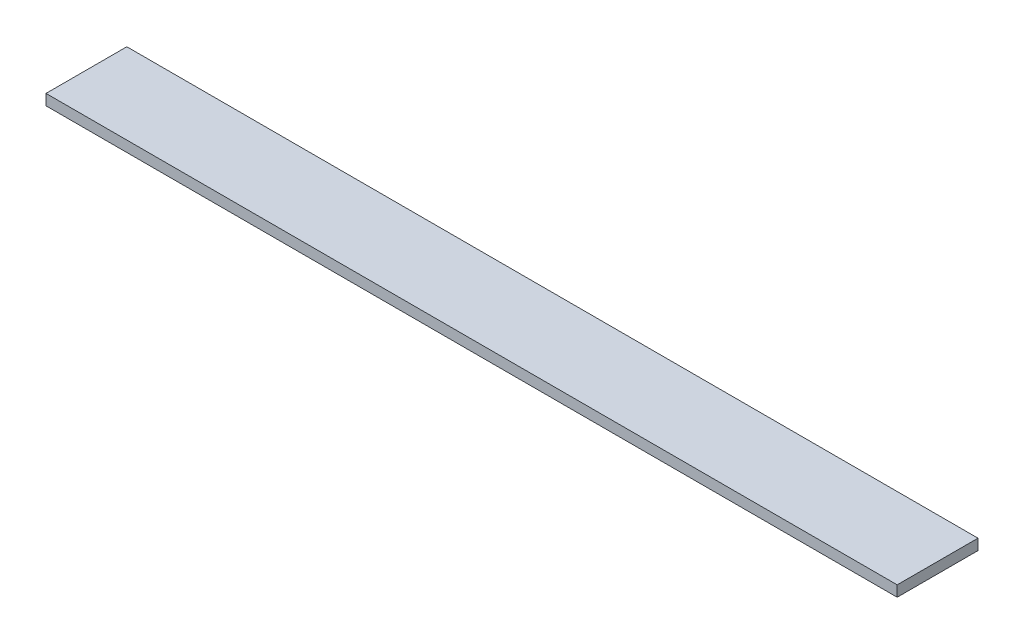
ISO-10303-21;
HEADER;
FILE_DESCRIPTION(('STEP AP214'),'2;1');
FILE_NAME('part.step','',(''),(''),'','','');
FILE_SCHEMA(('AUTOMOTIVE_DESIGN { 1 0 10303 214 1 1 1 1 }'));
ENDSEC;
DATA;
#1=APPLICATION_CONTEXT('core data for automotive mechanical design processes');
#2=APPLICATION_PROTOCOL_DEFINITION('international standard','automotive_design',2000,#1);
#3=PRODUCT_CONTEXT('',#1,'mechanical');
#4=PRODUCT('Part','Part','',(#3));
#5=PRODUCT_RELATED_PRODUCT_CATEGORY('part','',(#4));
#6=PRODUCT_DEFINITION_FORMATION('','',#4);
#7=PRODUCT_DEFINITION_CONTEXT('part definition',#1,'design');
#8=PRODUCT_DEFINITION('design','',#6,#7);
#9=PRODUCT_DEFINITION_SHAPE('','',#8);
#10=(LENGTH_UNIT() NAMED_UNIT(*) SI_UNIT(.MILLI.,.METRE.));
#11=(NAMED_UNIT(*) PLANE_ANGLE_UNIT() SI_UNIT($,.RADIAN.));
#12=(NAMED_UNIT(*) SI_UNIT($,.STERADIAN.) SOLID_ANGLE_UNIT());
#13=UNCERTAINTY_MEASURE_WITH_UNIT(LENGTH_MEASURE(1.E-05),#10,'distance_accuracy_value','');
#14=(GEOMETRIC_REPRESENTATION_CONTEXT(3) GLOBAL_UNCERTAINTY_ASSIGNED_CONTEXT((#13)) GLOBAL_UNIT_ASSIGNED_CONTEXT((#10,
#11,#12)) REPRESENTATION_CONTEXT('',''));
#15=CARTESIAN_POINT('',(0.,0.,0.));
#16=DIRECTION('',(0.,0.,1.));
#17=DIRECTION('',(1.,0.,0.));
#18=AXIS2_PLACEMENT_3D('',#15,#16,#17);
#19=CARTESIAN_POINT('',(316.,-2.,-15.));
#20=DIRECTION('',(0.,0.,1.));
#21=DIRECTION('',(1.,0.,0.));
#22=AXIS2_PLACEMENT_3D('',#19,#20,#21);
#23=PLANE('',#22);
#24=DIRECTION('',(0.,1.,0.));
#25=VECTOR('',#24,1.);
#26=CARTESIAN_POINT('',(0.,-2.,-15.));
#27=LINE('',#26,#25);
#28=CARTESIAN_POINT('',(0.,-2.,-15.));
#29=VERTEX_POINT('',#28);
#30=CARTESIAN_POINT('',(0.,2.,-15.));
#31=VERTEX_POINT('',#30);
#32=EDGE_CURVE('E98',#29,#31,#27,.T.);
#33=ORIENTED_EDGE('',*,*,#32,.T.);
#34=DIRECTION('',(-1.,0.,0.));
#35=VECTOR('',#34,1.);
#36=CARTESIAN_POINT('',(316.,2.,-15.));
#37=LINE('',#36,#35);
#38=CARTESIAN_POINT('',(316.,2.,-15.));
#39=VERTEX_POINT('',#38);
#40=EDGE_CURVE('E11',#39,#31,#37,.T.);
#41=ORIENTED_EDGE('',*,*,#40,.F.);
#42=DIRECTION('',(0.,1.,0.));
#43=VECTOR('',#42,1.);
#44=CARTESIAN_POINT('',(316.,-2.,-15.));
#45=LINE('',#44,#43);
#46=CARTESIAN_POINT('',(316.,-2.,-15.));
#47=VERTEX_POINT('',#46);
#48=EDGE_CURVE('E86',#47,#39,#45,.T.);
#49=ORIENTED_EDGE('',*,*,#48,.F.);
#50=DIRECTION('',(-1.,0.,0.));
#51=VECTOR('',#50,1.);
#52=CARTESIAN_POINT('',(316.,-2.,-15.));
#53=LINE('',#52,#51);
#54=EDGE_CURVE('E94',#47,#29,#53,.T.);
#55=ORIENTED_EDGE('',*,*,#54,.T.);
#56=EDGE_LOOP('',(#33,#41,#49,#55));
#57=FACE_BOUND('',#56,.T.);
#58=ADVANCED_FACE('F35',(#57),#23,.F.);
#59=CARTESIAN_POINT('',(316.,2.,15.));
#60=DIRECTION('',(0.,-1.,0.));
#61=DIRECTION('',(0.,0.,-1.));
#62=AXIS2_PLACEMENT_3D('',#59,#60,#61);
#63=PLANE('',#62);
#64=DIRECTION('',(0.,0.,1.));
#65=VECTOR('',#64,1.);
#66=CARTESIAN_POINT('',(0.,2.,15.));
#67=LINE('',#66,#65);
#68=CARTESIAN_POINT('',(0.,2.,15.));
#69=VERTEX_POINT('',#68);
#70=EDGE_CURVE('E90',#31,#69,#67,.T.);
#71=ORIENTED_EDGE('',*,*,#70,.T.);
#72=DIRECTION('',(-1.,0.,0.));
#73=VECTOR('',#72,1.);
#74=CARTESIAN_POINT('',(316.,2.,15.));
#75=LINE('',#74,#73);
#76=CARTESIAN_POINT('',(316.,2.,15.));
#77=VERTEX_POINT('',#76);
#78=EDGE_CURVE('E43',#77,#69,#75,.T.);
#79=ORIENTED_EDGE('',*,*,#78,.F.);
#80=DIRECTION('',(0.,0.,1.));
#81=VECTOR('',#80,1.);
#82=CARTESIAN_POINT('',(316.,2.,15.));
#83=LINE('',#82,#81);
#84=EDGE_CURVE('E81',#39,#77,#83,.T.);
#85=ORIENTED_EDGE('',*,*,#84,.F.);
#86=ORIENTED_EDGE('',*,*,#40,.T.);
#87=EDGE_LOOP('',(#71,#79,#85,#86));
#88=FACE_BOUND('',#87,.T.);
#89=ADVANCED_FACE('F89',(#88),#63,.F.);
#90=CARTESIAN_POINT('',(316.,-2.,15.));
#91=DIRECTION('',(0.,0.,-1.));
#92=DIRECTION('',(-1.,0.,0.));
#93=AXIS2_PLACEMENT_3D('',#90,#91,#92);
#94=PLANE('',#93);
#95=DIRECTION('',(0.,-1.,0.));
#96=VECTOR('',#95,1.);
#97=CARTESIAN_POINT('',(0.,-2.,15.));
#98=LINE('',#97,#96);
#99=CARTESIAN_POINT('',(0.,-2.,15.));
#100=VERTEX_POINT('',#99);
#101=EDGE_CURVE('E68',#69,#100,#98,.T.);
#102=ORIENTED_EDGE('',*,*,#101,.T.);
#103=DIRECTION('',(-1.,0.,0.));
#104=VECTOR('',#103,1.);
#105=CARTESIAN_POINT('',(316.,-2.,15.));
#106=LINE('',#105,#104);
#107=CARTESIAN_POINT('',(316.,-2.,15.));
#108=VERTEX_POINT('',#107);
#109=EDGE_CURVE('E91',#108,#100,#106,.T.);
#110=ORIENTED_EDGE('',*,*,#109,.F.);
#111=DIRECTION('',(0.,-1.,0.));
#112=VECTOR('',#111,1.);
#113=CARTESIAN_POINT('',(316.,-2.,15.));
#114=LINE('',#113,#112);
#115=EDGE_CURVE('E84',#77,#108,#114,.T.);
#116=ORIENTED_EDGE('',*,*,#115,.F.);
#117=ORIENTED_EDGE('',*,*,#78,.T.);
#118=EDGE_LOOP('',(#102,#110,#116,#117));
#119=FACE_BOUND('',#118,.T.);
#120=ADVANCED_FACE('F92',(#119),#94,.F.);
#121=CARTESIAN_POINT('',(316.,-2.,15.));
#122=DIRECTION('',(0.,1.,0.));
#123=DIRECTION('',(0.,0.,1.));
#124=AXIS2_PLACEMENT_3D('',#121,#122,#123);
#125=PLANE('',#124);
#126=DIRECTION('',(0.,0.,-1.));
#127=VECTOR('',#126,1.);
#128=CARTESIAN_POINT('',(0.,-2.,15.));
#129=LINE('',#128,#127);
#130=EDGE_CURVE('E74',#100,#29,#129,.T.);
#131=ORIENTED_EDGE('',*,*,#130,.T.);
#132=ORIENTED_EDGE('',*,*,#54,.F.);
#133=DIRECTION('',(0.,0.,-1.));
#134=VECTOR('',#133,1.);
#135=CARTESIAN_POINT('',(316.,-2.,15.));
#136=LINE('',#135,#134);
#137=EDGE_CURVE('E51',#108,#47,#136,.T.);
#138=ORIENTED_EDGE('',*,*,#137,.F.);
#139=ORIENTED_EDGE('',*,*,#109,.T.);
#140=EDGE_LOOP('',(#131,#132,#138,#139));
#141=FACE_BOUND('',#140,.T.);
#142=ADVANCED_FACE('F105',(#141),#125,.F.);
#143=CARTESIAN_POINT('',(316.,0.,0.));
#144=DIRECTION('',(-1.,0.,0.));
#145=DIRECTION('',(0.,0.,1.));
#146=AXIS2_PLACEMENT_3D('',#143,#144,#145);
#147=PLANE('',#146);
#148=ORIENTED_EDGE('',*,*,#48,.T.);
#149=ORIENTED_EDGE('',*,*,#84,.T.);
#150=ORIENTED_EDGE('',*,*,#115,.T.);
#151=ORIENTED_EDGE('',*,*,#137,.T.);
#152=EDGE_LOOP('',(#148,#149,#150,#151));
#153=FACE_BOUND('',#152,.T.);
#154=ADVANCED_FACE('F82',(#153),#147,.F.);
#155=CARTESIAN_POINT('',(0.,0.,0.));
#156=DIRECTION('',(-1.,0.,0.));
#157=DIRECTION('',(0.,0.,1.));
#158=AXIS2_PLACEMENT_3D('',#155,#156,#157);
#159=PLANE('',#158);
#160=ORIENTED_EDGE('',*,*,#32,.F.);
#161=ORIENTED_EDGE('',*,*,#130,.F.);
#162=ORIENTED_EDGE('',*,*,#101,.F.);
#163=ORIENTED_EDGE('',*,*,#70,.F.);
#164=EDGE_LOOP('',(#160,#161,#162,#163));
#165=FACE_BOUND('',#164,.T.);
#166=ADVANCED_FACE('F108',(#165),#159,.T.);
#167=CLOSED_SHELL('',(#58,#89,#120,#142,#154,#166));
#168=MANIFOLD_SOLID_BREP('B2',#167);
#169=ADVANCED_BREP_SHAPE_REPRESENTATION('',(#18,#168),#14);
#170=SHAPE_DEFINITION_REPRESENTATION(#9,#169);
ENDSEC;
END-ISO-10303-21;
